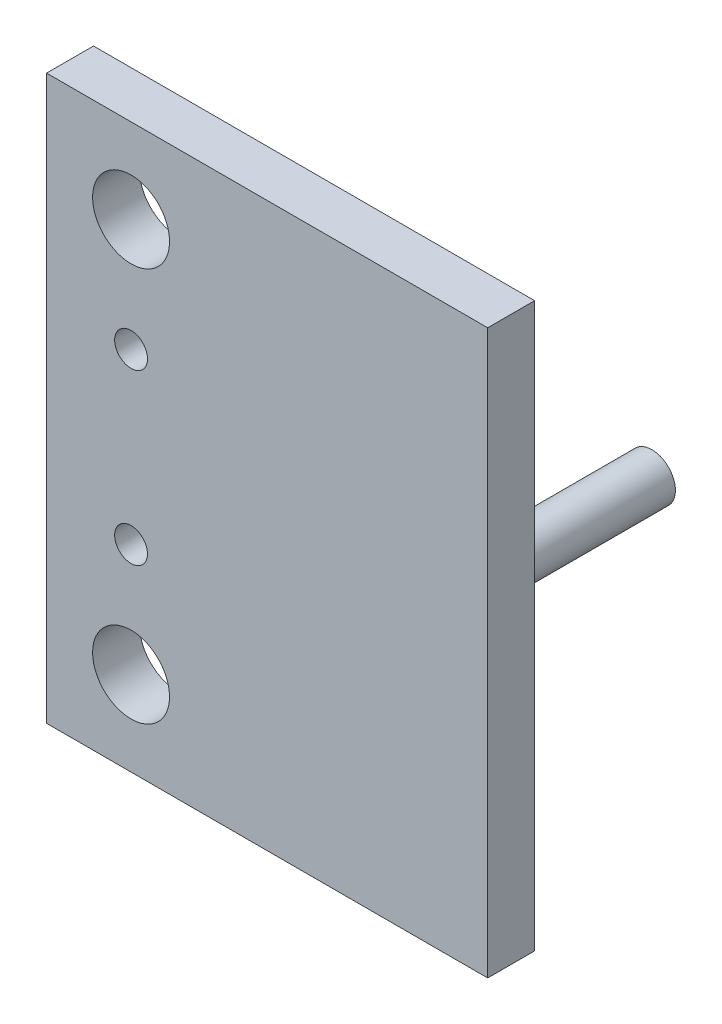
ISO-10303-21;
HEADER;
FILE_DESCRIPTION(('STEP AP214'),'2;1');
FILE_NAME('part.step','',(''),(''),'','','');
FILE_SCHEMA(('AUTOMOTIVE_DESIGN { 1 0 10303 214 1 1 1 1 }'));
ENDSEC;
DATA;
#1=APPLICATION_CONTEXT('core data for automotive mechanical design processes');
#2=APPLICATION_PROTOCOL_DEFINITION('international standard','automotive_design',2000,#1);
#3=PRODUCT_CONTEXT('',#1,'mechanical');
#4=PRODUCT('Part','Part','',(#3));
#5=PRODUCT_RELATED_PRODUCT_CATEGORY('part','',(#4));
#6=PRODUCT_DEFINITION_FORMATION('','',#4);
#7=PRODUCT_DEFINITION_CONTEXT('part definition',#1,'design');
#8=PRODUCT_DEFINITION('design','',#6,#7);
#9=PRODUCT_DEFINITION_SHAPE('','',#8);
#10=(LENGTH_UNIT() NAMED_UNIT(*) SI_UNIT(.MILLI.,.METRE.));
#11=(NAMED_UNIT(*) PLANE_ANGLE_UNIT() SI_UNIT($,.RADIAN.));
#12=(NAMED_UNIT(*) SI_UNIT($,.STERADIAN.) SOLID_ANGLE_UNIT());
#13=UNCERTAINTY_MEASURE_WITH_UNIT(LENGTH_MEASURE(1.E-05),#10,'distance_accuracy_value','');
#14=(GEOMETRIC_REPRESENTATION_CONTEXT(3) GLOBAL_UNCERTAINTY_ASSIGNED_CONTEXT((#13)) GLOBAL_UNIT_ASSIGNED_CONTEXT((#10,
#11,#12)) REPRESENTATION_CONTEXT('',''));
#15=CARTESIAN_POINT('',(0.,0.,0.));
#16=DIRECTION('',(0.,0.,1.));
#17=DIRECTION('',(1.,0.,0.));
#18=AXIS2_PLACEMENT_3D('',#15,#16,#17);
#19=CARTESIAN_POINT('',(5.,-22.3993288590604,-13.0872483221476));
#20=DIRECTION('',(0.,0.,1.));
#21=DIRECTION('',(1.,0.,0.));
#22=AXIS2_PLACEMENT_3D('',#19,#20,#21);
#23=PLANE('',#22);
#24=CARTESIAN_POINT('',(-13.,16.6006711409396,-13.0872483221476));
#25=DIRECTION('',(0.,0.,-1.));
#26=DIRECTION('',(-1.,0.,0.));
#27=AXIS2_PLACEMENT_3D('',#24,#25,#26);
#28=CIRCLE('',#27,1.75);
#29=CARTESIAN_POINT('',(-14.75,16.6006711409396,-13.0872483221476));
#30=VERTEX_POINT('',#29);
#31=EDGE_CURVE('E161',#30,#30,#28,.T.);
#32=ORIENTED_EDGE('',*,*,#31,.F.);
#33=EDGE_LOOP('',(#32));
#34=FACE_BOUND('',#33,.T.);
#35=CARTESIAN_POINT('',(-13.,-1.39932885906042,-13.0872483221476));
#36=DIRECTION('',(0.,0.,-1.));
#37=DIRECTION('',(-1.,0.,0.));
#38=AXIS2_PLACEMENT_3D('',#35,#36,#37);
#39=CIRCLE('',#38,1.75);
#40=CARTESIAN_POINT('',(-14.75,-1.39932885906042,-13.0872483221476));
#41=VERTEX_POINT('',#40);
#42=EDGE_CURVE('E157',#41,#41,#39,.T.);
#43=ORIENTED_EDGE('',*,*,#42,.F.);
#44=EDGE_LOOP('',(#43));
#45=FACE_BOUND('',#44,.T.);
#46=CARTESIAN_POINT('',(-13.,-13.3993288590604,-13.0872483221476));
#47=DIRECTION('',(0.,0.,-1.));
#48=DIRECTION('',(-1.,0.,0.));
#49=AXIS2_PLACEMENT_3D('',#46,#47,#48);
#50=CIRCLE('',#49,4.1);
#51=CARTESIAN_POINT('',(-17.1,-13.3993288590604,-13.0872483221476));
#52=VERTEX_POINT('',#51);
#53=EDGE_CURVE('E152',#52,#52,#50,.T.);
#54=ORIENTED_EDGE('',*,*,#53,.F.);
#55=EDGE_LOOP('',(#54));
#56=FACE_BOUND('',#55,.T.);
#57=CARTESIAN_POINT('',(-13.,28.6006711409396,-13.0872483221476));
#58=DIRECTION('',(0.,0.,-1.));
#59=DIRECTION('',(-1.,0.,0.));
#60=AXIS2_PLACEMENT_3D('',#57,#58,#59);
#61=CIRCLE('',#60,4.1);
#62=CARTESIAN_POINT('',(-17.1,28.6006711409396,-13.0872483221476));
#63=VERTEX_POINT('',#62);
#64=EDGE_CURVE('E99',#63,#63,#61,.T.);
#65=ORIENTED_EDGE('',*,*,#64,.F.);
#66=EDGE_LOOP('',(#65));
#67=FACE_BOUND('',#66,.T.);
#68=DIRECTION('',(-1.,0.,0.));
#69=VECTOR('',#68,1.);
#70=CARTESIAN_POINT('',(5.,-22.3993288590604,-13.0872483221476));
#71=LINE('',#70,#69);
#72=CARTESIAN_POINT('',(25.,-22.3993288590604,-13.0872483221477));
#73=VERTEX_POINT('',#72);
#74=CARTESIAN_POINT('',(-22.,-22.3993288590604,-13.0872483221476));
#75=VERTEX_POINT('',#74);
#76=EDGE_CURVE('E75',#73,#75,#71,.T.);
#77=ORIENTED_EDGE('',*,*,#76,.T.);
#78=DIRECTION('',(0.,-1.,0.));
#79=VECTOR('',#78,1.);
#80=CARTESIAN_POINT('',(-22.,37.6006711409396,-13.0872483221476));
#81=LINE('',#80,#79);
#82=CARTESIAN_POINT('',(-22.,37.6006711409396,-13.0872483221476));
#83=VERTEX_POINT('',#82);
#84=EDGE_CURVE('E79',#83,#75,#81,.T.);
#85=ORIENTED_EDGE('',*,*,#84,.F.);
#86=DIRECTION('',(-1.,0.,0.));
#87=VECTOR('',#86,1.);
#88=CARTESIAN_POINT('',(5.,37.6006711409396,-13.0872483221476));
#89=LINE('',#88,#87);
#90=CARTESIAN_POINT('',(25.,37.6006711409396,-13.0872483221477));
#91=VERTEX_POINT('',#90);
#92=EDGE_CURVE('E58',#91,#83,#89,.T.);
#93=ORIENTED_EDGE('',*,*,#92,.F.);
#94=DIRECTION('',(0.,1.,0.));
#95=VECTOR('',#94,1.);
#96=CARTESIAN_POINT('',(25.,37.6006711409396,-13.0872483221477));
#97=LINE('',#96,#95);
#98=EDGE_CURVE('E80',#73,#91,#97,.T.);
#99=ORIENTED_EDGE('',*,*,#98,.F.);
#100=EDGE_LOOP('',(#77,#85,#93,#99));
#101=FACE_BOUND('',#100,.T.);
#102=CARTESIAN_POINT('',(17.5,7.60067114093958,-13.0872483221477));
#103=DIRECTION('',(0.,0.,1.));
#104=DIRECTION('',(1.,0.,0.));
#105=AXIS2_PLACEMENT_3D('',#102,#103,#104);
#106=CIRCLE('',#105,2.5);
#107=CARTESIAN_POINT('',(20.,7.60067114093958,-13.0872483221477));
#108=VERTEX_POINT('',#107);
#109=EDGE_CURVE('E11',#108,#108,#106,.F.);
#110=ORIENTED_EDGE('',*,*,#109,.F.);
#111=EDGE_LOOP('',(#110));
#112=FACE_BOUND('',#111,.T.);
#113=ADVANCED_FACE('F35',(#34,#45,#56,#67,#101,#112),#23,.F.);
#114=CARTESIAN_POINT('',(5.,-22.3993288590604,-8.08724832214765));
#115=DIRECTION('',(0.,0.,-1.));
#116=DIRECTION('',(-1.,0.,0.));
#117=AXIS2_PLACEMENT_3D('',#114,#115,#116);
#118=PLANE('',#117);
#119=CARTESIAN_POINT('',(-13.,16.6006711409396,-8.08724832214765));
#120=DIRECTION('',(0.,0.,-1.));
#121=DIRECTION('',(-1.,0.,0.));
#122=AXIS2_PLACEMENT_3D('',#119,#120,#121);
#123=CIRCLE('',#122,1.75);
#124=CARTESIAN_POINT('',(-14.75,16.6006711409396,-8.08724832214765));
#125=VERTEX_POINT('',#124);
#126=EDGE_CURVE('E133',#125,#125,#123,.T.);
#127=ORIENTED_EDGE('',*,*,#126,.T.);
#128=EDGE_LOOP('',(#127));
#129=FACE_BOUND('',#128,.T.);
#130=CARTESIAN_POINT('',(-13.,-1.39932885906042,-8.08724832214765));
#131=DIRECTION('',(0.,0.,-1.));
#132=DIRECTION('',(-1.,0.,0.));
#133=AXIS2_PLACEMENT_3D('',#130,#131,#132);
#134=CIRCLE('',#133,1.75);
#135=CARTESIAN_POINT('',(-14.75,-1.39932885906042,-8.08724832214765));
#136=VERTEX_POINT('',#135);
#137=EDGE_CURVE('E137',#136,#136,#134,.T.);
#138=ORIENTED_EDGE('',*,*,#137,.T.);
#139=EDGE_LOOP('',(#138));
#140=FACE_BOUND('',#139,.T.);
#141=CARTESIAN_POINT('',(-13.,-13.3993288590604,-8.08724832214765));
#142=DIRECTION('',(0.,0.,-1.));
#143=DIRECTION('',(-1.,0.,0.));
#144=AXIS2_PLACEMENT_3D('',#141,#142,#143);
#145=CIRCLE('',#144,4.1);
#146=CARTESIAN_POINT('',(-17.1,-13.3993288590604,-8.08724832214765));
#147=VERTEX_POINT('',#146);
#148=EDGE_CURVE('E141',#147,#147,#145,.T.);
#149=ORIENTED_EDGE('',*,*,#148,.T.);
#150=EDGE_LOOP('',(#149));
#151=FACE_BOUND('',#150,.T.);
#152=CARTESIAN_POINT('',(-13.,28.6006711409396,-8.08724832214765));
#153=DIRECTION('',(0.,0.,-1.));
#154=DIRECTION('',(-1.,0.,0.));
#155=AXIS2_PLACEMENT_3D('',#152,#153,#154);
#156=CIRCLE('',#155,4.1);
#157=CARTESIAN_POINT('',(-17.1,28.6006711409396,-8.08724832214765));
#158=VERTEX_POINT('',#157);
#159=EDGE_CURVE('E96',#158,#158,#156,.T.);
#160=ORIENTED_EDGE('',*,*,#159,.T.);
#161=EDGE_LOOP('',(#160));
#162=FACE_BOUND('',#161,.T.);
#163=DIRECTION('',(-1.,0.,0.));
#164=VECTOR('',#163,1.);
#165=CARTESIAN_POINT('',(5.,37.6006711409396,-8.08724832214765));
#166=LINE('',#165,#164);
#167=CARTESIAN_POINT('',(25.,37.6006711409396,-8.08724832214765));
#168=VERTEX_POINT('',#167);
#169=CARTESIAN_POINT('',(-22.,37.6006711409396,-8.08724832214765));
#170=VERTEX_POINT('',#169);
#171=EDGE_CURVE('E50',#168,#170,#166,.T.);
#172=ORIENTED_EDGE('',*,*,#171,.T.);
#173=DIRECTION('',(0.,1.,0.));
#174=VECTOR('',#173,1.);
#175=CARTESIAN_POINT('',(-22.,37.6006711409396,-8.08724832214765));
#176=LINE('',#175,#174);
#177=CARTESIAN_POINT('',(-22.,-22.3993288590604,-8.08724832214765));
#178=VERTEX_POINT('',#177);
#179=EDGE_CURVE('E91',#178,#170,#176,.T.);
#180=ORIENTED_EDGE('',*,*,#179,.F.);
#181=DIRECTION('',(-1.,0.,0.));
#182=VECTOR('',#181,1.);
#183=CARTESIAN_POINT('',(5.,-22.3993288590604,-8.08724832214765));
#184=LINE('',#183,#182);
#185=CARTESIAN_POINT('',(25.,-22.3993288590604,-8.08724832214766));
#186=VERTEX_POINT('',#185);
#187=EDGE_CURVE('E43',#186,#178,#184,.T.);
#188=ORIENTED_EDGE('',*,*,#187,.F.);
#189=DIRECTION('',(0.,-1.,0.));
#190=VECTOR('',#189,1.);
#191=CARTESIAN_POINT('',(25.,37.6006711409396,-8.08724832214765));
#192=LINE('',#191,#190);
#193=EDGE_CURVE('E108',#168,#186,#192,.T.);
#194=ORIENTED_EDGE('',*,*,#193,.F.);
#195=EDGE_LOOP('',(#172,#180,#188,#194));
#196=FACE_BOUND('',#195,.T.);
#197=ADVANCED_FACE('F37',(#129,#140,#151,#162,#196),#118,.F.);
#198=CARTESIAN_POINT('',(5.,-22.3993288590604,-8.08724832214765));
#199=DIRECTION('',(0.,1.,0.));
#200=DIRECTION('',(0.,0.,1.));
#201=AXIS2_PLACEMENT_3D('',#198,#199,#200);
#202=PLANE('',#201);
#203=ORIENTED_EDGE('',*,*,#187,.T.);
#204=DIRECTION('',(0.,0.,1.));
#205=VECTOR('',#204,1.);
#206=CARTESIAN_POINT('',(-22.,-22.3993288590604,-13.0872483221476));
#207=LINE('',#206,#205);
#208=EDGE_CURVE('E86',#75,#178,#207,.T.);
#209=ORIENTED_EDGE('',*,*,#208,.F.);
#210=ORIENTED_EDGE('',*,*,#76,.F.);
#211=DIRECTION('',(0.,0.,-1.));
#212=VECTOR('',#211,1.);
#213=CARTESIAN_POINT('',(25.,-22.3993288590604,-8.08724832214766));
#214=LINE('',#213,#212);
#215=EDGE_CURVE('E111',#186,#73,#214,.T.);
#216=ORIENTED_EDGE('',*,*,#215,.F.);
#217=EDGE_LOOP('',(#203,#209,#210,#216));
#218=FACE_BOUND('',#217,.T.);
#219=ADVANCED_FACE('F87',(#218),#202,.F.);
#220=CARTESIAN_POINT('',(5.,37.6006711409396,-8.08724832214765));
#221=DIRECTION('',(0.,-1.,0.));
#222=DIRECTION('',(0.,0.,-1.));
#223=AXIS2_PLACEMENT_3D('',#220,#221,#222);
#224=PLANE('',#223);
#225=ORIENTED_EDGE('',*,*,#92,.T.);
#226=DIRECTION('',(0.,0.,-1.));
#227=VECTOR('',#226,1.);
#228=CARTESIAN_POINT('',(-22.,37.6006711409396,-13.0872483221476));
#229=LINE('',#228,#227);
#230=EDGE_CURVE('E95',#170,#83,#229,.T.);
#231=ORIENTED_EDGE('',*,*,#230,.F.);
#232=ORIENTED_EDGE('',*,*,#171,.F.);
#233=DIRECTION('',(0.,0.,1.));
#234=VECTOR('',#233,1.);
#235=CARTESIAN_POINT('',(25.,37.6006711409396,-8.08724832214765));
#236=LINE('',#235,#234);
#237=EDGE_CURVE('E114',#91,#168,#236,.T.);
#238=ORIENTED_EDGE('',*,*,#237,.F.);
#239=EDGE_LOOP('',(#225,#231,#232,#238));
#240=FACE_BOUND('',#239,.T.);
#241=ADVANCED_FACE('F117',(#240),#224,.F.);
#242=CARTESIAN_POINT('',(25.,0.,0.));
#243=DIRECTION('',(1.,0.,0.));
#244=DIRECTION('',(0.,0.,-1.));
#245=AXIS2_PLACEMENT_3D('',#242,#243,#244);
#246=PLANE('',#245);
#247=ORIENTED_EDGE('',*,*,#193,.T.);
#248=ORIENTED_EDGE('',*,*,#215,.T.);
#249=ORIENTED_EDGE('',*,*,#98,.T.);
#250=ORIENTED_EDGE('',*,*,#237,.T.);
#251=EDGE_LOOP('',(#247,#248,#249,#250));
#252=FACE_BOUND('',#251,.T.);
#253=ADVANCED_FACE('F120',(#252),#246,.T.);
#254=CARTESIAN_POINT('',(17.5,7.60067114093958,-33.0872483221477));
#255=DIRECTION('',(0.,0.,1.));
#256=DIRECTION('',(0.,-1.,0.));
#257=AXIS2_PLACEMENT_3D('',#254,#255,#256);
#258=CYLINDRICAL_SURFACE('',#257,2.5);
#259=CARTESIAN_POINT('',(17.5,7.60067114093958,-33.0872483221477));
#260=DIRECTION('',(0.,0.,-1.));
#261=DIRECTION('',(0.,1.,0.));
#262=AXIS2_PLACEMENT_3D('',#259,#260,#261);
#263=CIRCLE('',#262,2.5);
#264=CARTESIAN_POINT('',(17.5,10.1006711409396,-33.0872483221477));
#265=VERTEX_POINT('',#264);
#266=EDGE_CURVE('E105',#265,#265,#263,.T.);
#267=ORIENTED_EDGE('',*,*,#266,.F.);
#268=EDGE_LOOP('',(#267));
#269=FACE_BOUND('',#268,.T.);
#270=ORIENTED_EDGE('',*,*,#109,.T.);
#271=EDGE_LOOP('',(#270));
#272=FACE_BOUND('',#271,.T.);
#273=ADVANCED_FACE('F188',(#269,#272),#258,.T.);
#274=CARTESIAN_POINT('',(17.5,7.60067114093958,-33.0872483221477));
#275=DIRECTION('',(0.,0.,-1.));
#276=DIRECTION('',(0.,1.,0.));
#277=AXIS2_PLACEMENT_3D('',#274,#275,#276);
#278=PLANE('',#277);
#279=ORIENTED_EDGE('',*,*,#266,.T.);
#280=EDGE_LOOP('',(#279));
#281=FACE_BOUND('',#280,.T.);
#282=ADVANCED_FACE('F185',(#281),#278,.T.);
#283=CARTESIAN_POINT('',(-22.,0.,0.));
#284=DIRECTION('',(-1.,0.,0.));
#285=DIRECTION('',(0.,0.,1.));
#286=AXIS2_PLACEMENT_3D('',#283,#284,#285);
#287=PLANE('',#286);
#288=ORIENTED_EDGE('',*,*,#84,.T.);
#289=ORIENTED_EDGE('',*,*,#208,.T.);
#290=ORIENTED_EDGE('',*,*,#179,.T.);
#291=ORIENTED_EDGE('',*,*,#230,.T.);
#292=EDGE_LOOP('',(#288,#289,#290,#291));
#293=FACE_BOUND('',#292,.T.);
#294=ADVANCED_FACE('F94',(#293),#287,.T.);
#295=CARTESIAN_POINT('',(-13.,28.6006711409396,-8.08724832214765));
#296=DIRECTION('',(0.,0.,-1.));
#297=DIRECTION('',(-1.,0.,0.));
#298=AXIS2_PLACEMENT_3D('',#295,#296,#297);
#299=CYLINDRICAL_SURFACE('',#298,4.1);
#300=ORIENTED_EDGE('',*,*,#159,.F.);
#301=EDGE_LOOP('',(#300));
#302=FACE_BOUND('',#301,.T.);
#303=ORIENTED_EDGE('',*,*,#64,.T.);
#304=EDGE_LOOP('',(#303));
#305=FACE_BOUND('',#304,.T.);
#306=ADVANCED_FACE('F144',(#302,#305),#299,.F.);
#307=CARTESIAN_POINT('',(-13.,-13.3993288590604,-8.08724832214765));
#308=DIRECTION('',(0.,0.,-1.));
#309=DIRECTION('',(-1.,0.,0.));
#310=AXIS2_PLACEMENT_3D('',#307,#308,#309);
#311=CYLINDRICAL_SURFACE('',#310,4.1);
#312=ORIENTED_EDGE('',*,*,#148,.F.);
#313=EDGE_LOOP('',(#312));
#314=FACE_BOUND('',#313,.T.);
#315=ORIENTED_EDGE('',*,*,#53,.T.);
#316=EDGE_LOOP('',(#315));
#317=FACE_BOUND('',#316,.T.);
#318=ADVANCED_FACE('F147',(#314,#317),#311,.F.);
#319=CARTESIAN_POINT('',(-13.,-1.39932885906042,-8.08724832214765));
#320=DIRECTION('',(0.,0.,-1.));
#321=DIRECTION('',(-1.,0.,0.));
#322=AXIS2_PLACEMENT_3D('',#319,#320,#321);
#323=CYLINDRICAL_SURFACE('',#322,1.75);
#324=ORIENTED_EDGE('',*,*,#137,.F.);
#325=EDGE_LOOP('',(#324));
#326=FACE_BOUND('',#325,.T.);
#327=ORIENTED_EDGE('',*,*,#42,.T.);
#328=EDGE_LOOP('',(#327));
#329=FACE_BOUND('',#328,.T.);
#330=ADVANCED_FACE('F173',(#326,#329),#323,.F.);
#331=CARTESIAN_POINT('',(-13.,16.6006711409396,-8.08724832214765));
#332=DIRECTION('',(0.,0.,-1.));
#333=DIRECTION('',(-1.,0.,0.));
#334=AXIS2_PLACEMENT_3D('',#331,#332,#333);
#335=CYLINDRICAL_SURFACE('',#334,1.75);
#336=ORIENTED_EDGE('',*,*,#126,.F.);
#337=EDGE_LOOP('',(#336));
#338=FACE_BOUND('',#337,.T.);
#339=ORIENTED_EDGE('',*,*,#31,.T.);
#340=EDGE_LOOP('',(#339));
#341=FACE_BOUND('',#340,.T.);
#342=ADVANCED_FACE('F166',(#338,#341),#335,.F.);
#343=CLOSED_SHELL('',(#113,#197,#219,#241,#253,#273,#282,#294,#306,#318,#330,#342));
#344=MANIFOLD_SOLID_BREP('B2',#343);
#345=ADVANCED_BREP_SHAPE_REPRESENTATION('',(#18,#344),#14);
#346=SHAPE_DEFINITION_REPRESENTATION(#9,#345);
ENDSEC;
END-ISO-10303-21;
